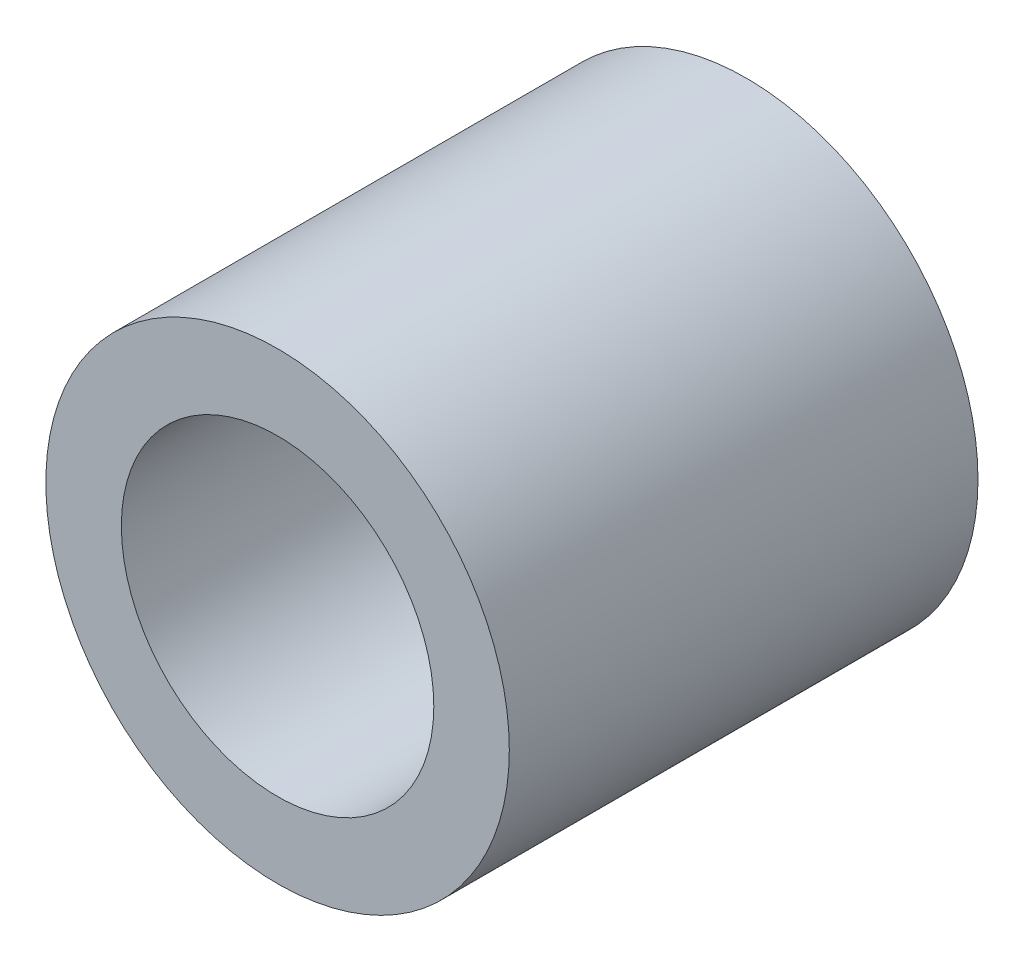
ISO-10303-21;
HEADER;
FILE_DESCRIPTION(('STEP AP214'),'2;1');
FILE_NAME('part.step','',(''),(''),'','','');
FILE_SCHEMA(('AUTOMOTIVE_DESIGN { 1 0 10303 214 1 1 1 1 }'));
ENDSEC;
DATA;
#1=APPLICATION_CONTEXT('core data for automotive mechanical design processes');
#2=APPLICATION_PROTOCOL_DEFINITION('international standard','automotive_design',2000,#1);
#3=PRODUCT_CONTEXT('',#1,'mechanical');
#4=PRODUCT('Part','Part','',(#3));
#5=PRODUCT_RELATED_PRODUCT_CATEGORY('part','',(#4));
#6=PRODUCT_DEFINITION_FORMATION('','',#4);
#7=PRODUCT_DEFINITION_CONTEXT('part definition',#1,'design');
#8=PRODUCT_DEFINITION('design','',#6,#7);
#9=PRODUCT_DEFINITION_SHAPE('','',#8);
#10=(LENGTH_UNIT() NAMED_UNIT(*) SI_UNIT(.MILLI.,.METRE.));
#11=(NAMED_UNIT(*) PLANE_ANGLE_UNIT() SI_UNIT($,.RADIAN.));
#12=(NAMED_UNIT(*) SI_UNIT($,.STERADIAN.) SOLID_ANGLE_UNIT());
#13=UNCERTAINTY_MEASURE_WITH_UNIT(LENGTH_MEASURE(1.E-05),#10,'distance_accuracy_value','');
#14=(GEOMETRIC_REPRESENTATION_CONTEXT(3) GLOBAL_UNCERTAINTY_ASSIGNED_CONTEXT((#13)) GLOBAL_UNIT_ASSIGNED_CONTEXT((#10,
#11,#12)) REPRESENTATION_CONTEXT('',''));
#15=CARTESIAN_POINT('',(0.,0.,0.));
#16=DIRECTION('',(0.,0.,1.));
#17=DIRECTION('',(1.,0.,0.));
#18=AXIS2_PLACEMENT_3D('',#15,#16,#17);
#19=CARTESIAN_POINT('',(0.,0.,9.));
#20=DIRECTION('',(0.,0.,1.));
#21=DIRECTION('',(1.,0.,0.));
#22=AXIS2_PLACEMENT_3D('',#19,#20,#21);
#23=PLANE('',#22);
#24=CARTESIAN_POINT('',(0.,0.,9.));
#25=DIRECTION('',(0.,0.,1.));
#26=DIRECTION('',(1.,0.,0.));
#27=AXIS2_PLACEMENT_3D('',#24,#25,#26);
#28=CIRCLE('',#27,4.45);
#29=CARTESIAN_POINT('',(4.45,0.,9.));
#30=VERTEX_POINT('',#29);
#31=EDGE_CURVE('E10',#30,#30,#28,.T.);
#32=ORIENTED_EDGE('',*,*,#31,.T.);
#33=EDGE_LOOP('',(#32));
#34=FACE_BOUND('',#33,.T.);
#35=CARTESIAN_POINT('',(0.,0.,9.));
#36=DIRECTION('',(0.,0.,1.));
#37=DIRECTION('',(1.,0.,0.));
#38=AXIS2_PLACEMENT_3D('',#35,#36,#37);
#39=CIRCLE('',#38,3.);
#40=CARTESIAN_POINT('',(3.,0.,9.));
#41=VERTEX_POINT('',#40);
#42=EDGE_CURVE('E50',#41,#41,#39,.T.);
#43=ORIENTED_EDGE('',*,*,#42,.F.);
#44=EDGE_LOOP('',(#43));
#45=FACE_BOUND('',#44,.T.);
#46=ADVANCED_FACE('F37',(#34,#45),#23,.T.);
#47=CARTESIAN_POINT('',(0.,0.,0.));
#48=DIRECTION('',(0.,0.,1.));
#49=DIRECTION('',(1.,0.,0.));
#50=AXIS2_PLACEMENT_3D('',#47,#48,#49);
#51=PLANE('',#50);
#52=CARTESIAN_POINT('',(0.,0.,0.));
#53=DIRECTION('',(0.,0.,1.));
#54=DIRECTION('',(1.,0.,0.));
#55=AXIS2_PLACEMENT_3D('',#52,#53,#54);
#56=CIRCLE('',#55,4.45);
#57=CARTESIAN_POINT('',(4.45,0.,0.));
#58=VERTEX_POINT('',#57);
#59=EDGE_CURVE('E41',#58,#58,#56,.T.);
#60=ORIENTED_EDGE('',*,*,#59,.F.);
#61=EDGE_LOOP('',(#60));
#62=FACE_BOUND('',#61,.T.);
#63=CARTESIAN_POINT('',(0.,0.,0.));
#64=DIRECTION('',(0.,0.,1.));
#65=DIRECTION('',(1.,0.,0.));
#66=AXIS2_PLACEMENT_3D('',#63,#64,#65);
#67=CIRCLE('',#66,3.);
#68=CARTESIAN_POINT('',(3.,0.,0.));
#69=VERTEX_POINT('',#68);
#70=EDGE_CURVE('E52',#69,#69,#67,.T.);
#71=ORIENTED_EDGE('',*,*,#70,.T.);
#72=EDGE_LOOP('',(#71));
#73=FACE_BOUND('',#72,.T.);
#74=ADVANCED_FACE('F64',(#62,#73),#51,.F.);
#75=CARTESIAN_POINT('',(0.,0.,9.));
#76=DIRECTION('',(0.,0.,-1.));
#77=DIRECTION('',(-1.,0.,0.));
#78=AXIS2_PLACEMENT_3D('',#75,#76,#77);
#79=CYLINDRICAL_SURFACE('',#78,4.45);
#80=ORIENTED_EDGE('',*,*,#31,.F.);
#81=EDGE_LOOP('',(#80));
#82=FACE_BOUND('',#81,.T.);
#83=ORIENTED_EDGE('',*,*,#59,.T.);
#84=EDGE_LOOP('',(#83));
#85=FACE_BOUND('',#84,.T.);
#86=ADVANCED_FACE('F39',(#82,#85),#79,.T.);
#87=CARTESIAN_POINT('',(0.,0.,9.));
#88=DIRECTION('',(0.,0.,-1.));
#89=DIRECTION('',(-1.,0.,0.));
#90=AXIS2_PLACEMENT_3D('',#87,#88,#89);
#91=CYLINDRICAL_SURFACE('',#90,3.);
#92=ORIENTED_EDGE('',*,*,#42,.T.);
#93=EDGE_LOOP('',(#92));
#94=FACE_BOUND('',#93,.T.);
#95=ORIENTED_EDGE('',*,*,#70,.F.);
#96=EDGE_LOOP('',(#95));
#97=FACE_BOUND('',#96,.T.);
#98=ADVANCED_FACE('F60',(#94,#97),#91,.F.);
#99=CLOSED_SHELL('',(#46,#74,#86,#98));
#100=MANIFOLD_SOLID_BREP('B2',#99);
#101=ADVANCED_BREP_SHAPE_REPRESENTATION('',(#18,#100),#14);
#102=SHAPE_DEFINITION_REPRESENTATION(#9,#101);
ENDSEC;
END-ISO-10303-21;
